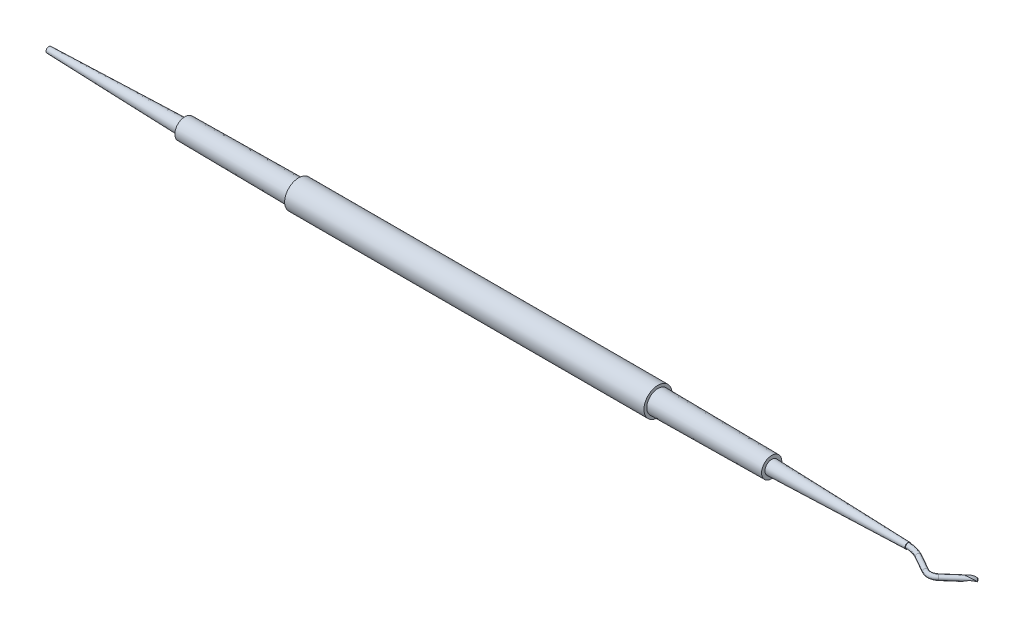
ISO-10303-21;
HEADER;
FILE_DESCRIPTION(('STEP AP214'),'2;1');
FILE_NAME('part.step','',(''),(''),'','','');
FILE_SCHEMA(('AUTOMOTIVE_DESIGN { 1 0 10303 214 1 1 1 1 }'));
ENDSEC;
DATA;
#1=APPLICATION_CONTEXT('core data for automotive mechanical design processes');
#2=APPLICATION_PROTOCOL_DEFINITION('international standard','automotive_design',2000,#1);
#3=PRODUCT_CONTEXT('',#1,'mechanical');
#4=PRODUCT('Part','Part','',(#3));
#5=PRODUCT_RELATED_PRODUCT_CATEGORY('part','',(#4));
#6=PRODUCT_DEFINITION_FORMATION('','',#4);
#7=PRODUCT_DEFINITION_CONTEXT('part definition',#1,'design');
#8=PRODUCT_DEFINITION('design','',#6,#7);
#9=PRODUCT_DEFINITION_SHAPE('','',#8);
#10=(LENGTH_UNIT() NAMED_UNIT(*) SI_UNIT(.MILLI.,.METRE.));
#11=(NAMED_UNIT(*) PLANE_ANGLE_UNIT() SI_UNIT($,.RADIAN.));
#12=(NAMED_UNIT(*) SI_UNIT($,.STERADIAN.) SOLID_ANGLE_UNIT());
#13=UNCERTAINTY_MEASURE_WITH_UNIT(LENGTH_MEASURE(1.E-05),#10,'distance_accuracy_value','');
#14=(GEOMETRIC_REPRESENTATION_CONTEXT(3) GLOBAL_UNCERTAINTY_ASSIGNED_CONTEXT((#13)) GLOBAL_UNIT_ASSIGNED_CONTEXT((#10,
#11,#12)) REPRESENTATION_CONTEXT('',''));
#15=CARTESIAN_POINT('',(0.,0.,0.));
#16=DIRECTION('',(0.,0.,1.));
#17=DIRECTION('',(1.,0.,0.));
#18=AXIS2_PLACEMENT_3D('',#15,#16,#17);
#19=CARTESIAN_POINT('',(63.6969930566618,0.,-30.1608804847367));
#20=DIRECTION('',(0.707106781186546,5.9604644836623E-08,-0.707106781186546));
#21=DIRECTION('',(-0.707106781186548,0.,-0.707106781186548));
#22=AXIS2_PLACEMENT_3D('',#19,#20,#21);
#23=CIRCLE('',#22,0.425000000000001);
#24=DIRECTION('',(0.752843126221306,0.,-0.658199990353487));
#25=VECTOR('',#24,1.);
#26=SURFACE_OF_LINEAR_EXTRUSION('',#23,#25);
#27=CARTESIAN_POINT('',(63.3964726746575,0.,-30.4614008667409));
#28=VERTEX_POINT('',#27);
#29=EDGE_CURVE('E174',#28,#28,#23,.T.);
#30=ORIENTED_EDGE('',*,*,#29,.T.);
#31=EDGE_LOOP('',(#30));
#32=FACE_BOUND('',#31,.T.);
#33=CARTESIAN_POINT('',(67.6511873969928,-0.258658752841257,-33.1710451259865));
#34=CARTESIAN_POINT('',(67.6528045494839,-0.24429116295213,-33.1579142887532));
#35=CARTESIAN_POINT('',(67.6535727690092,-0.229456959110943,-33.1453880770501));
#36=CARTESIAN_POINT('',(67.653411342128,-0.198855323524447,-33.1215449047044));
#37=CARTESIAN_POINT('',(67.6524816957216,-0.183087891779138,-33.1102279440617));
#38=CARTESIAN_POINT('',(67.6507031163494,-0.166853846081768,-33.0995156089493));
#39=B_SPLINE_CURVE_WITH_KNOTS('',3,(#33,#34,#35,#36,#37,#38),.UNSPECIFIED.,.F.,.F.,(4,2,4),(0.,
0.0582919179667387,0.116583835933478),.UNSPECIFIED.);
#40=CARTESIAN_POINT('',(67.6511873969928,-0.258658752841257,-33.1710451259865));
#41=VERTEX_POINT('',#40);
#42=CARTESIAN_POINT('',(67.6507031163494,-0.166853846081765,-33.0995156089493));
#43=VERTEX_POINT('',#42);
#44=EDGE_CURVE('E47',#41,#43,#39,.T.);
#45=ORIENTED_EDGE('',*,*,#44,.T.);
#46=CARTESIAN_POINT('',(67.6507031163494,-0.166853846081757,-33.0995156089493));
#47=CARTESIAN_POINT('',(67.6437455442857,-0.156078227115985,-33.08733965316));
#48=CARTESIAN_POINT('',(67.6362743139802,-0.145346648935356,-33.07543088082));
#49=CARTESIAN_POINT('',(67.6204099658853,-0.124034160674299,-33.0521217833227));
#50=CARTESIAN_POINT('',(67.6120175476423,-0.113453143063015,-33.0407210814638));
#51=CARTESIAN_POINT('',(67.5875937174699,-0.0843793389244943,-33.0097447208781));
#52=CARTESIAN_POINT('',(67.5706749068561,-0.0660976993231702,-32.990667082251));
#53=CARTESIAN_POINT('',(67.5346907839806,-0.0303530884627027,-32.953796697354));
#54=CARTESIAN_POINT('',(67.5156235172787,-0.0128908834262404,-32.9360051455755));
#55=CARTESIAN_POINT('',(67.4558715775179,0.0379787119219545,-32.8844072292486));
#56=CARTESIAN_POINT('',(67.4125398571444,0.0699805907076151,-32.8522626271264));
#57=CARTESIAN_POINT('',(67.3210207243787,0.129735904654552,-32.7913984281136));
#58=CARTESIAN_POINT('',(67.2728372215585,0.15749271577668,-32.7626761136504));
#59=CARTESIAN_POINT('',(67.1729461661692,0.208757610183487,-32.7077879807982));
#60=CARTESIAN_POINT('',(67.1212401551242,0.232267535755102,-32.6816210561623));
#61=CARTESIAN_POINT('',(67.0152664141436,0.275107483525564,-32.6312127860484));
#62=CARTESIAN_POINT('',(66.9609993363274,0.294438562854347,-32.6069709545602));
#63=CARTESIAN_POINT('',(66.8506006968685,0.329027529275209,-32.5599202414545));
#64=CARTESIAN_POINT('',(66.7944694239258,0.344286043791555,-32.5371111395235));
#65=CARTESIAN_POINT('',(66.6808786659113,0.370828459307692,-32.4925549487387));
#66=CARTESIAN_POINT('',(66.6234193071219,0.382112736559233,-32.4708077595188));
#67=CARTESIAN_POINT('',(66.5062091594492,0.401011375293602,-32.4275514743997));
#68=CARTESIAN_POINT('',(66.4464364163068,0.408531676929487,-32.4060604617622));
#69=CARTESIAN_POINT('',(66.3679282345576,0.41572425609031,-32.3785891610623));
#70=CARTESIAN_POINT('',(66.3494924808867,0.417221578234038,-32.3721921573082));
#71=CARTESIAN_POINT('',(66.3125454844976,0.419839639900346,-32.3595421650755));
#72=CARTESIAN_POINT('',(66.2940342456117,0.420960398306228,-32.3532891693901));
#73=CARTESIAN_POINT('',(66.2636425512783,0.42248601501354,-32.3433443001972));
#74=CARTESIAN_POINT('',(66.2518026655252,0.423002942848195,-32.3395491143053));
#75=CARTESIAN_POINT('',(66.2323990359157,0.42372120317685,-32.3336754765893));
#76=CARTESIAN_POINT('',(66.2248715356617,0.423968575195228,-32.3314807946055));
#77=CARTESIAN_POINT('',(66.2123507132798,0.424326063527001,-32.3281683299119));
#78=CARTESIAN_POINT('',(66.2073905551131,0.424453942341993,-32.3269421468421));
#79=CARTESIAN_POINT('',(66.1990931601383,0.424643061234417,-32.3252475693451));
#80=CARTESIAN_POINT('',(66.1957766236008,0.424712186131435,-32.324663234684));
#81=CARTESIAN_POINT('',(66.1891855006548,0.424834964550152,-32.3238696410187));
#82=CARTESIAN_POINT('',(66.1859140974136,0.424889105592861,-32.323646991518));
#83=CARTESIAN_POINT('',(66.1814748726344,0.424948121658036,-32.3241494061104));
#84=CARTESIAN_POINT('',(66.1802669068749,0.424962669605739,-32.324370237));
#85=CARTESIAN_POINT('',(66.1779226235479,0.424986089391464,-32.3251535324298));
#86=CARTESIAN_POINT('',(66.1767872134721,0.424994898672586,-32.3257196359968));
#87=CARTESIAN_POINT('',(66.1751563812516,0.425000793818929,-32.3270949986066));
#88=CARTESIAN_POINT('',(66.1745707888271,0.425000460160245,-32.3277927311136));
#89=CARTESIAN_POINT('',(66.1736673073348,0.424994359684992,-32.3293328655104));
#90=CARTESIAN_POINT('',(66.1733484062992,0.424988613584307,-32.3301747057859));
#91=CARTESIAN_POINT('',(66.1727155492817,0.42496713263638,-32.3326515426011));
#92=CARTESIAN_POINT('',(66.172648457182,0.424947056848973,-32.3343379718675));
#93=CARTESIAN_POINT('',(66.1728723287709,0.424877894302242,-32.3394063916986));
#94=CARTESIAN_POINT('',(66.1736066208746,0.424820308891583,-32.3427335956496));
#95=CARTESIAN_POINT('',(66.1754001750184,0.424691350473712,-32.3493117416951));
#96=CARTESIAN_POINT('',(66.1764627017238,0.424619841751555,-32.3525615474696));
#97=CARTESIAN_POINT('',(66.1798451387075,0.424389906937479,-32.3620948741987));
#98=CARTESIAN_POINT('',(66.1823935459102,0.42421390184582,-32.3682983355549));
#99=CARTESIAN_POINT('',(66.187683162078,0.423817070036864,-32.3806211981264));
#100=CARTESIAN_POINT('',(66.1904246135467,0.42359618626183,-32.3867404816386));
#101=CARTESIAN_POINT('',(66.1959969041315,0.423111527548993,-32.3988896795957));
#102=CARTESIAN_POINT('',(66.1988270402961,0.422848042969012,-32.4049199168643));
#103=CARTESIAN_POINT('',(66.2045443914714,0.422277550581856,-32.4169460955671));
#104=CARTESIAN_POINT('',(66.2074315715549,0.421970568737712,-32.4229420552562));
#105=CARTESIAN_POINT('',(66.2219631619519,0.420325503979314,-32.4528953249947));
#106=CARTESIAN_POINT('',(66.2338650061401,0.418659760019526,-32.4767107237203));
#107=CARTESIAN_POINT('',(66.2578395314483,0.414627654725028,-32.5242035675893));
#108=CARTESIAN_POINT('',(66.2699122693541,0.412261055041607,-32.5478809630024));
#109=CARTESIAN_POINT('',(66.2942088179677,0.406819375520685,-32.5951311620099));
#110=CARTESIAN_POINT('',(66.3064328597344,0.40374303949088,-32.6187037037108));
#111=CARTESIAN_POINT('',(66.3309943941912,0.396880683550806,-32.6656818919974));
#112=CARTESIAN_POINT('',(66.3433318762392,0.393094729578351,-32.6890875538801));
#113=CARTESIAN_POINT('',(66.3804659430073,0.38068550605793,-32.7588984901474));
#114=CARTESIAN_POINT('',(66.4054478021747,0.370996653728389,-32.8050218097191));
#115=CARTESIAN_POINT('',(66.4560308067797,0.348725398149464,-32.8962219659259));
#116=CARTESIAN_POINT('',(66.4816319822873,0.336142854147587,-32.9412987515388));
#117=CARTESIAN_POINT('',(66.5337036377941,0.307989507963047,-33.0301650803742));
#118=CARTESIAN_POINT('',(66.5601761406788,0.292411275751515,-33.0739511040906));
#119=CARTESIAN_POINT('',(66.6141500341152,0.258227406575446,-33.159665137125));
#120=CARTESIAN_POINT('',(66.6416512223902,0.239622362406729,-33.2015935082193));
#121=CARTESIAN_POINT('',(66.6979116412786,0.199368026463909,-33.2829544007512));
#122=CARTESIAN_POINT('',(66.72666831356,0.177724743033453,-33.3223916306471));
#123=CARTESIAN_POINT('',(66.7858422184484,0.131341943507186,-33.3981218761712));
#124=CARTESIAN_POINT('',(66.8162599087895,0.10660157148021,-33.4344140178924));
#125=CARTESIAN_POINT('',(66.8791911294972,0.0540883064027667,-33.5028364489158));
#126=CARTESIAN_POINT('',(66.9117056257442,0.0263140116479241,-33.534964799387));
#127=CARTESIAN_POINT('',(66.9749562987444,-0.0281961748381158,-33.5897805263988));
#128=CARTESIAN_POINT('',(67.0053752170644,-0.0545986506160452,-33.6131520876014));
#129=CARTESIAN_POINT('',(67.0530307302808,-0.09562398207578,-33.6441524944955));
#130=CARTESIAN_POINT('',(67.0694075219606,-0.109666427796053,-33.6538770488798));
#131=CARTESIAN_POINT('',(67.1028395377284,-0.138061412966175,-33.6716378723126));
#132=CARTESIAN_POINT('',(67.11989571802,-0.152414375476507,-33.6796716540989));
#133=CARTESIAN_POINT('',(67.137306241785,-0.166853846081759,-33.6867342563268));
#134=B_SPLINE_CURVE_WITH_KNOTS('',3,(#46,#47,#48,#49,#50,#51,#52,#53,#54,#55,#56,#57,#58,#59,
#60,#61,#62,#63,#64,#65,#66,#67,#68,#69,#70,#71,#72,#73,#74,#75,#76,#77,#78,#79,#80,#81,#82,#83,
#84,#85,#86,#87,#88,#89,#90,#91,#92,#93,#94,#95,#96,#97,#98,#99,#100,#101,#102,#103,#104,#105,
#106,#107,#108,#109,#110,#111,#112,#113,#114,#115,#116,#117,#118,#119,#120,#121,#122,#123,#124,
#125,#126,#127,#128,#129,#130,#131,#132,#133),.UNSPECIFIED.,.F.,.F.,(4,2,2,2,2,2,2,2,2,2,2,2,2,
2,2,2,2,2,2,2,2,2,2,2,2,2,2,2,2,2,2,2,2,2,2,2,2,2,2,2,2,2,2,4),(0.,0.0530330355999665,
0.106026073177627,0.200010813964857,0.294081753204683,0.481667918282324,0.669104117794824,
0.856458811727566,1.04376605461255,1.23104442403847,1.41830505854752,1.61003691416296,
1.66874862900401,1.72745739922639,1.76478323653067,1.78831905059973,1.80363450989081,
1.81375060771837,1.82348286278468,1.82714866496847,1.83085378731138,1.8335277001599,
1.83619142013251,1.84117821033633,1.85133505623803,1.8615963660805,1.88170022115322,
1.90182979757174,1.92182754977982,1.94181341544612,2.02182594460916,2.10186571593596,
2.18204825486523,2.26222334691014,2.42215353645507,2.58209150683444,2.74243140116676,
2.90273993093132,3.06273579142086,3.22277596741169,3.38289039891325,3.52221527905958,
3.5931408208341,3.66416998151407),.UNSPECIFIED.);
#135=CARTESIAN_POINT('',(67.137306241785,-0.166853846081765,-33.6867342563268));
#136=VERTEX_POINT('',#135);
#137=EDGE_CURVE('E11',#43,#136,#134,.T.);
#138=ORIENTED_EDGE('',*,*,#137,.T.);
#139=CARTESIAN_POINT('',(67.137306241785,-0.166853846081765,-33.6867342563268));
#140=CARTESIAN_POINT('',(67.1481601443111,-0.183087891771699,-33.6870663198518));
#141=CARTESIAN_POINT('',(67.1594998853307,-0.198855323513189,-33.6864763095287));
#142=CARTESIAN_POINT('',(67.1831510443566,-0.229456959099287,-33.6834521411864));
#143=CARTESIAN_POINT('',(67.195462462363,-0.244291162943894,-33.6810179831672));
#144=CARTESIAN_POINT('',(67.2082597188628,-0.258658752840058,-33.6776617512999));
#145=B_SPLINE_CURVE_WITH_KNOTS('',3,(#139,#140,#141,#142,#143,#144),.UNSPECIFIED.,.F.,.F.,(4,2,
4),(0.,0.0582919177986592,0.116583835597326),.UNSPECIFIED.);
#146=CARTESIAN_POINT('',(67.2082597188621,-0.258658752841257,-33.6776617512993));
#147=VERTEX_POINT('',#146);
#148=EDGE_CURVE('E94',#136,#147,#145,.T.);
#149=ORIENTED_EDGE('',*,*,#148,.T.);
#150=CARTESIAN_POINT('',(67.2082597188626,-0.258658752841215,-33.6776617512987));
#151=CARTESIAN_POINT('',(67.1802820012183,-0.245570495625067,-33.6664479209341));
#152=CARTESIAN_POINT('',(67.152771234666,-0.232928934422802,-33.6537098257842));
#153=CARTESIAN_POINT('',(67.0985946905032,-0.208753178425956,-33.625853853145));
#154=CARTESIAN_POINT('',(67.0719265347801,-0.197215637115919,-33.6107435594707));
#155=CARTESIAN_POINT('',(67.0052884862757,-0.169629940565738,-33.5703088847398));
#156=CARTESIAN_POINT('',(66.9657061785008,-0.15440439226653,-33.5437948069971));
#157=CARTESIAN_POINT('',(66.8873210973976,-0.127074523450579,-33.4879745468059));
#158=CARTESIAN_POINT('',(66.8485204574919,-0.114977895252638,-33.4586617212457));
#159=CARTESIAN_POINT('',(66.7711599088592,-0.0940022735049208,-33.3980789908946));
#160=CARTESIAN_POINT('',(66.7326032636704,-0.0851449739298108,-33.3667974785005));
#161=CARTESIAN_POINT('',(66.6557414659007,-0.0708179745754755,-33.3031420228818));
#162=CARTESIAN_POINT('',(66.6174364230336,-0.0653496666439142,-33.2707676365655));
#163=CARTESIAN_POINT('',(66.5410209775717,-0.0578366256922296,-33.205417244065));
#164=CARTESIAN_POINT('',(66.5029105301574,-0.0557910652641313,-33.1724413852286));
#165=CARTESIAN_POINT('',(66.4269694700037,-0.0551310684600747,-33.106161475021));
#166=CARTESIAN_POINT('',(66.3891387723274,-0.0565155438303682,-33.0728575310812));
#167=CARTESIAN_POINT('',(66.3067945706879,-0.0632993399987038,-32.9995950860713));
#168=CARTESIAN_POINT('',(66.2623868885887,-0.0694159464142125,-32.9595821945022));
#169=CARTESIAN_POINT('',(66.1750515064675,-0.0864580434115003,-32.8790154819311));
#170=CARTESIAN_POINT('',(66.1321227571341,-0.0973800454726768,-32.8384620739934));
#171=CARTESIAN_POINT('',(66.0637470241865,-0.119180382665745,-32.7708847367859));
#172=CARTESIAN_POINT('',(66.0375270206458,-0.128684226637528,-32.7441954607835));
#173=CARTESIAN_POINT('',(65.9866359410563,-0.149564266150504,-32.6901168330276));
#174=CARTESIAN_POINT('',(65.9619636384875,-0.160938952518723,-32.662728060466));
#175=CARTESIAN_POINT('',(65.9141966352896,-0.185735848511297,-32.6063023214763));
#176=CARTESIAN_POINT('',(65.8911490898595,-0.19919789163293,-32.5772422678051));
#177=CARTESIAN_POINT('',(65.8588658842258,-0.220625011124829,-32.5325200233485));
#178=CARTESIAN_POINT('',(65.848472883833,-0.227984529871102,-32.5174013662388));
#179=CARTESIAN_POINT('',(65.8286102466047,-0.243064632599637,-32.4867269959797));
#180=CARTESIAN_POINT('',(65.8191412781775,-0.250785472060949,-32.4711709767848));
#181=CARTESIAN_POINT('',(65.8102148753809,-0.258658752841249,-32.4553711167116));
#182=B_SPLINE_CURVE_WITH_KNOTS('',3,(#150,#151,#152,#153,#154,#155,#156,#157,#158,#159,#160,
#161,#162,#163,#164,#165,#166,#167,#168,#169,#170,#171,#172,#173,#174,#175,#176,#177,#178,#179,
#180,#181),.UNSPECIFIED.,.F.,.F.,(4,2,2,2,2,2,2,2,2,2,2,2,2,2,2,4),(0.,0.0984586315110298,
0.196608675093287,0.346424599443237,0.496605412468146,0.647774335110639,0.799005301258977,
0.9501997038587,1.10134614287648,1.28140305838815,1.46132947507233,1.57706667843567,
1.69271097263077,1.81092139927881,1.8701972529889,1.92951567153437),.UNSPECIFIED.);
#183=CARTESIAN_POINT('',(65.8102148753789,-0.258658752841257,-32.4553711167139));
#184=VERTEX_POINT('',#183);
#185=EDGE_CURVE('E83',#147,#184,#182,.T.);
#186=ORIENTED_EDGE('',*,*,#185,.T.);
#187=CARTESIAN_POINT('',(66.2900205884006,0.0674437386742544,-32.9840509806894));
#188=CARTESIAN_POINT('',(66.2643997822545,0.0527406776402467,-32.9647753499176));
#189=CARTESIAN_POINT('',(66.2392572877631,0.0380179738631719,-32.9448877289413));
#190=CARTESIAN_POINT('',(66.1899604255579,0.00855793825302269,-32.9039339439726));
#191=CARTESIAN_POINT('',(66.1658060489455,-0.00617939344709588,-32.8828677905974));
#192=CARTESIAN_POINT('',(66.0948363621088,-0.0503987428245335,-32.8179368447281));
#193=CARTESIAN_POINT('',(66.0495528481736,-0.0798660859064056,-32.7723684840827));
#194=CARTESIAN_POINT('',(65.9637472764439,-0.138524835060358,-32.6766973779446));
#195=CARTESIAN_POINT('',(65.9232265166547,-0.167716163925588,-32.6265934029051));
#196=CARTESIAN_POINT('',(65.8672156689508,-0.210983061157589,-32.5476996767273));
#197=CARTESIAN_POINT('',(65.8493275668627,-0.22533037593558,-32.520754873225));
#198=CARTESIAN_POINT('',(65.8155305379099,-0.253749559447364,-32.4655116066498));
#199=CARTESIAN_POINT('',(65.7996208546331,-0.267821531708544,-32.4372136666885));
#200=CARTESIAN_POINT('',(65.7703732126167,-0.29551805495409,-32.3791545991734));
#201=CARTESIAN_POINT('',(65.7570315929455,-0.309143219537263,-32.3493956315639));
#202=CARTESIAN_POINT('',(65.7338395709497,-0.335711879623463,-32.2881367808883));
#203=CARTESIAN_POINT('',(65.7239926978349,-0.348654674864151,-32.2566351748855));
#204=CARTESIAN_POINT('',(65.7122411175268,-0.36889849744288,-32.203188786204));
#205=CARTESIAN_POINT('',(65.7087631039807,-0.376589332624566,-32.1817555704411));
#206=CARTESIAN_POINT('',(65.70505406464,-0.391014155183455,-32.1383367907528));
#207=CARTESIAN_POINT('',(65.7048121490201,-0.397751276137085,-32.1163533288406));
#208=CARTESIAN_POINT('',(65.7092374067538,-0.410019190209617,-32.0707572691874));
#209=CARTESIAN_POINT('',(65.7142199457168,-0.415445102257521,-32.0471304973399));
#210=CARTESIAN_POINT('',(65.727368871278,-0.421147640296118,-32.013249085589));
#211=CARTESIAN_POINT('',(65.7327603495666,-0.42264424115994,-32.0021374339362));
#212=CARTESIAN_POINT('',(65.7455467762826,-0.424605743217495,-31.9810314250443));
#213=CARTESIAN_POINT('',(65.7529381911805,-0.425072450857632,-31.9710351407333));
#214=CARTESIAN_POINT('',(65.7682747598701,-0.424920644512247,-31.9539948980804));
#215=CARTESIAN_POINT('',(65.7759815758156,-0.424450602347291,-31.9467329817304));
#216=CARTESIAN_POINT('',(65.7923937396488,-0.422765058893588,-31.9335301134082));
#217=CARTESIAN_POINT('',(65.8011008786003,-0.421548202990423,-31.9275915886235));
#218=CARTESIAN_POINT('',(65.8332120102835,-0.416089949075966,-31.9088978203654));
#219=CARTESIAN_POINT('',(65.858471300073,-0.410084367578449,-31.8998495546026));
#220=CARTESIAN_POINT('',(65.9049295570339,-0.397187487354217,-31.8893236866796));
#221=CARTESIAN_POINT('',(65.9260597648345,-0.390638689784297,-31.8867930706796));
#222=CARTESIAN_POINT('',(65.9682192132868,-0.376651427702967,-31.8847868779945));
#223=CARTESIAN_POINT('',(65.9892480838433,-0.369210840083617,-31.8853187395949));
#224=CARTESIAN_POINT('',(66.0310946172084,-0.353710599862177,-31.8886694967027));
#225=CARTESIAN_POINT('',(66.0519080814141,-0.345645512863017,-31.8915111503584));
#226=CARTESIAN_POINT('',(66.0930731445994,-0.329143346677167,-31.8989518365643));
#227=CARTESIAN_POINT('',(66.1134244450131,-0.320706036833223,-31.9035519727274));
#228=CARTESIAN_POINT('',(66.1551239676478,-0.302946258973837,-31.9145366315719));
#229=CARTESIAN_POINT('',(66.1764353253044,-0.293604347142389,-31.921027564037));
#230=CARTESIAN_POINT('',(66.2185314052475,-0.274707727915836,-31.9353148888147));
#231=CARTESIAN_POINT('',(66.2393157820186,-0.265152888252404,-31.9431121133533));
#232=CARTESIAN_POINT('',(66.2806197882083,-0.245774169191445,-31.9598983138725));
#233=CARTESIAN_POINT('',(66.301133012435,-0.235948425967503,-31.9689007743332));
#234=CARTESIAN_POINT('',(66.3416187427822,-0.216195802040492,-31.9878583326351));
#235=CARTESIAN_POINT('',(66.3615920511617,-0.206269105423032,-31.9978119046214));
#236=CARTESIAN_POINT('',(66.3813224345087,-0.196302899475698,-32.0081738750472));
#237=B_SPLINE_CURVE_WITH_KNOTS('',3,(#187,#188,#189,#190,#191,#192,#193,#194,#195,#196,#197,
#198,#199,#200,#201,#202,#203,#204,#205,#206,#207,#208,#209,#210,#211,#212,#213,#214,#215,#216,
#217,#218,#219,#220,#221,#222,#223,#224,#225,#226,#227,#228,#229,#230,#231,#232,#233,#234,#235,
#236),.UNSPECIFIED.,.F.,.F.,(4,2,2,2,2,2,2,2,2,2,2,2,2,2,2,2,2,2,2,2,2,2,2,2,4),(0.,
0.105800013367014,0.211599073746606,0.42335518233639,0.635168868186571,0.741252056558328,
0.847294560454202,0.95318475615018,1.05918158401838,1.12810067102071,1.19678777915251,
1.26987354609439,1.30697977257714,1.34402086233903,1.37565481941378,1.40734632629246,
1.48817493544366,1.55476192449799,1.62151071118521,1.68892525560625,1.75638217863308,
1.8288037904344,1.90127171803265,1.97463140552348,2.04787531824744),.UNSPECIFIED.);
#238=CARTESIAN_POINT('',(66.2531425535137,-0.258658752839964,-31.9487544914006));
#239=VERTEX_POINT('',#238);
#240=EDGE_CURVE('E78',#184,#239,#237,.T.);
#241=ORIENTED_EDGE('',*,*,#240,.T.);
#242=CARTESIAN_POINT('',(66.2531425535109,-0.258658752841259,-31.9487544913995));
#243=CARTESIAN_POINT('',(66.2811184433904,-0.245571399606541,-31.959967516509));
#244=CARTESIAN_POINT('',(66.3086273031949,-0.232930675200975,-31.9727046470512));
#245=CARTESIAN_POINT('',(66.3628038557105,-0.208754769294081,-32.0005603195098));
#246=CARTESIAN_POINT('',(66.3894738223382,-0.197216387984019,-32.0156716098462));
#247=CARTESIAN_POINT('',(66.4565496326794,-0.169449581303954,-32.0563716825776));
#248=CARTESIAN_POINT('',(66.4965533551331,-0.154075043538436,-32.0831953281891));
#249=CARTESIAN_POINT('',(66.575712405549,-0.126537309497611,-32.1396410888984));
#250=CARTESIAN_POINT('',(66.6148668189258,-0.114377431288413,-32.1692660529494));
#251=CARTESIAN_POINT('',(66.6928782360191,-0.0933540311036968,-32.2304472531736));
#252=CARTESIAN_POINT('',(66.731732677842,-0.0845077676160026,-32.2620126305327));
#253=CARTESIAN_POINT('',(66.8091597111309,-0.070264007169429,-32.3262107512928));
#254=CARTESIAN_POINT('',(66.8477324070188,-0.0648651609243523,-32.3588430718391));
#255=CARTESIAN_POINT('',(66.9244309726151,-0.0575644709316384,-32.4244917271417));
#256=CARTESIAN_POINT('',(66.9625581039543,-0.0556394115744727,-32.4575040174097));
#257=CARTESIAN_POINT('',(67.0385471601704,-0.055224852727571,-32.5238677976532));
#258=CARTESIAN_POINT('',(67.0764090358043,-0.0567359750329596,-32.5572193479325));
#259=CARTESIAN_POINT('',(67.1515152029923,-0.063179548693823,-32.6241007622875));
#260=CARTESIAN_POINT('',(67.188760779109,-0.0681036186604254,-32.657629990292));
#261=CARTESIAN_POINT('',(67.2622922151856,-0.0813362454996726,-32.7250485198451));
#262=CARTESIAN_POINT('',(67.2985784407945,-0.0896434925044792,-32.7589376770996));
#263=CARTESIAN_POINT('',(67.3643181226703,-0.108110395649817,-32.8223153855905));
#264=CARTESIAN_POINT('',(67.3939876927776,-0.117813577685142,-32.8517124538313));
#265=CARTESIAN_POINT('',(67.4516090048666,-0.139556613334639,-32.9112445214609));
#266=CARTESIAN_POINT('',(67.4795629286306,-0.151593414680686,-32.9413785124799));
#267=CARTESIAN_POINT('',(67.5337538788533,-0.178229915766972,-33.0035976224143));
#268=CARTESIAN_POINT('',(67.5599294126721,-0.192886853271706,-33.0357128383802));
#269=CARTESIAN_POINT('',(67.5964782709941,-0.216441901454891,-33.0852532005328));
#270=CARTESIAN_POINT('',(67.6082289580632,-0.224572497867557,-33.1020284562832));
#271=CARTESIAN_POINT('',(67.6306067003276,-0.241290920635079,-33.1361161319714));
#272=CARTESIAN_POINT('',(67.6412327120094,-0.249879160692709,-33.153429031825));
#273=CARTESIAN_POINT('',(67.6511873969928,-0.258658752841244,-33.1710451259864));
#274=B_SPLINE_CURVE_WITH_KNOTS('',3,(#242,#243,#244,#245,#246,#247,#248,#249,#250,#251,#252,
#253,#254,#255,#256,#257,#258,#259,#260,#261,#262,#263,#264,#265,#266,#267,#268,#269,#270,#271,
#272,#273),.UNSPECIFIED.,.F.,.F.,(4,2,2,2,2,2,2,2,2,2,2,2,2,2,2,4),(0.,0.0984518700744764,
0.196608676476319,0.348045861753214,0.49963875058335,0.652010559137899,0.804322694208213,
0.955613090563104,1.10693086588861,1.25787835124327,1.40876744959418,1.53731251753577,
1.66569057503312,1.79732324045698,1.86339642234946,1.92953038155447),.UNSPECIFIED.);
#275=EDGE_CURVE('E89',#239,#41,#274,.T.);
#276=ORIENTED_EDGE('',*,*,#275,.T.);
#277=EDGE_LOOP('',(#45,#138,#149,#186,#241,#276));
#278=FACE_BOUND('',#277,.T.);
#279=ADVANCED_FACE('F32',(#32,#278),#26,.T.);
#280=CARTESIAN_POINT('',(58.6475548694359,0.,-31.6139719657644));
#281=DIRECTION('',(0.901142029145555,5.9604644836623E-08,0.433523982390164));
#282=DIRECTION('',(0.433523982390165,0.,-0.901142029145557));
#283=AXIS2_PLACEMENT_3D('',#280,#281,#282);
#284=CIRCLE('',#283,0.425000000000001);
#285=CARTESIAN_POINT('',(56.1007794856014,0.,-27.1178129547974));
#286=DIRECTION('',(0.,1.,0.));
#287=AXIS1_PLACEMENT('',#285,#286);
#288=SURFACE_OF_REVOLUTION('',#284,#287);
#289=CARTESIAN_POINT('',(58.8318025619517,0.,-31.9969573281512));
#290=VERTEX_POINT('',#289);
#291=EDGE_CURVE('E202',#290,#290,#284,.T.);
#292=ORIENTED_EDGE('',*,*,#291,.F.);
#293=EDGE_LOOP('',(#292));
#294=FACE_BOUND('',#293,.T.);
#295=CARTESIAN_POINT('',(56.1007794856014,0.424999999999832,-32.2851630296092));
#296=CARTESIAN_POINT('',(56.1007794856011,0.425020466931518,-32.3089851707164));
#297=CARTESIAN_POINT('',(56.1007794856012,0.42298934388977,-32.3328008363431));
#298=CARTESIAN_POINT('',(56.1007794856015,0.414975843758688,-32.379739218147));
#299=CARTESIAN_POINT('',(56.1007794856017,0.408996630670456,-32.4028624737228));
#300=CARTESIAN_POINT('',(56.1007794856016,0.393234996082388,-32.4477860774439));
#301=CARTESIAN_POINT('',(56.1007794856013,0.383450917837889,-32.4695858445181));
#302=CARTESIAN_POINT('',(56.1007794856014,0.360368864011758,-32.5112323237803));
#303=CARTESIAN_POINT('',(56.1007794856018,0.347071507258352,-32.5310793790746));
#304=CARTESIAN_POINT('',(56.1007794856018,0.317332419457146,-32.5682747619284));
#305=CARTESIAN_POINT('',(56.1007794856014,0.300889104998015,-32.5856218234591));
#306=CARTESIAN_POINT('',(56.1007794856014,0.265305386508557,-32.6173403888102));
#307=CARTESIAN_POINT('',(56.1007794856019,0.246161214362847,-32.6317076649913));
#308=CARTESIAN_POINT('',(56.1007794856019,0.205725235286263,-32.6570397917126));
#309=CARTESIAN_POINT('',(56.1007794856014,0.184432189205565,-32.6680026640743));
#310=CARTESIAN_POINT('',(56.1007794856014,0.140279707446608,-32.6862204462232));
#311=CARTESIAN_POINT('',(56.100779485602,0.117418101793713,-32.6934700968085));
#312=CARTESIAN_POINT('',(56.100779485602,0.0707998270538761,-32.7040355768036));
#313=CARTESIAN_POINT('',(56.1007794856014,0.0470430249886139,-32.7073508193751));
#314=CARTESIAN_POINT('',(56.1007794856014,-0.000730289591681288,-32.7099549002989));
#315=CARTESIAN_POINT('',(56.1007794856021,-0.0247471706640772,-32.7092369807506));
#316=CARTESIAN_POINT('',(56.1007794856021,-0.0723386801020896,-32.7037768917454));
#317=CARTESIAN_POINT('',(56.1007794856014,-0.0959129387659259,-32.6990314989222));
#318=CARTESIAN_POINT('',(56.1007794856014,-0.141889890360478,-32.6856570874754));
#319=CARTESIAN_POINT('',(56.1007794856021,-0.164294476776442,-32.6770345774357));
#320=CARTESIAN_POINT('',(56.1007794856023,-0.207363720162289,-32.6561374946616));
#321=CARTESIAN_POINT('',(56.1007794856016,-0.228026275491038,-32.6438585894021));
#322=CARTESIAN_POINT('',(56.1007794856011,-0.26696340876817,-32.6160191476977));
#323=CARTESIAN_POINT('',(56.1007794856013,-0.285241327540766,-32.6004632839121));
#324=CARTESIAN_POINT('',(56.1007794856014,-0.318921393184504,-32.5664988698903));
#325=CARTESIAN_POINT('',(56.1007794856014,-0.334323486251836,-32.5480902662939));
#326=CARTESIAN_POINT('',(56.1007794856014,-0.361789093969117,-32.5089701636934));
#327=CARTESIAN_POINT('',(56.1007794856014,-0.373857325728822,-32.488261977199));
#328=CARTESIAN_POINT('',(56.1007794856014,-0.394333141012377,-32.4451221750208));
#329=CARTESIAN_POINT('',(56.1007794856013,-0.402742481422613,-32.4226913925751));
#330=CARTESIAN_POINT('',(56.1007794856015,-0.415652014942598,-32.376762932385));
#331=CARTESIAN_POINT('',(56.1007794856019,-0.420158251242324,-32.3532669634518));
#332=CARTESIAN_POINT('',(56.1007794856019,-0.424222718212436,-32.314818299947));
#333=CARTESIAN_POINT('',(56.1007794856018,-0.425006370058467,-32.2999871531943));
#334=CARTESIAN_POINT('',(56.1007794856014,-0.424999999999832,-32.2851637866598));
#335=B_SPLINE_CURVE_WITH_KNOTS('',3,(#295,#296,#297,#298,#299,#300,#301,#302,#303,#304,#305,
#306,#307,#308,#309,#310,#311,#312,#313,#314,#315,#316,#317,#318,#319,#320,#321,#322,#323,#324,
#325,#326,#327,#328,#329,#330,#331,#332,#333,#334),.UNSPECIFIED.,.F.,.F.,(4,2,2,2,2,2,2,2,2,2,2,
2,2,2,2,2,2,2,2,4),(0.,0.0713706522130541,0.142684177259909,0.214028789040578,0.285360842562652,
0.356728893561818,0.428197517243004,0.49970759143964,0.571318670401143,0.6429404292023,
0.714682232011692,0.786481507184415,0.858160699068,0.929925165125219,1.00158798565507,
1.07325214679001,1.1448143841834,1.21634222158153,1.28775911318768,1.33222924739058),.UNSPECIFIED.);
#336=CARTESIAN_POINT('',(56.1007794856014,0.425,-32.2851630296093));
#337=VERTEX_POINT('',#336);
#338=CARTESIAN_POINT('',(56.1007794856014,-0.424999999999832,-32.2851637866599));
#339=VERTEX_POINT('',#338);
#340=EDGE_CURVE('E168',#337,#339,#335,.T.);
#341=ORIENTED_EDGE('',*,*,#340,.F.);
#342=CARTESIAN_POINT('',(56.1007794856014,0.,-32.2851634081347));
#343=DIRECTION('',(0.997758156276635,5.9604644836623E-08,-0.0669228031648955));
#344=DIRECTION('',(-0.0669228031648955,0.,-0.997758156276636));
#345=AXIS2_PLACEMENT_3D('',#342,#343,#344);
#346=CIRCLE('',#345,0.425000000000001);
#347=EDGE_CURVE('E204',#337,#339,#346,.T.);
#348=ORIENTED_EDGE('',*,*,#347,.T.);
#349=EDGE_LOOP('',(#341,#348));
#350=FACE_BOUND('',#349,.T.);
#351=ADVANCED_FACE('F34',(#294,#350),#288,.T.);
#352=CARTESIAN_POINT('',(56.1007794856014,0.,-32.2851634081347));
#353=DIRECTION('',(0.997758156276635,5.9604644836623E-08,-0.0669228031648955));
#354=DIRECTION('',(-0.0669228031648955,0.,-0.997758156276636));
#355=AXIS2_PLACEMENT_3D('',#352,#353,#354);
#356=PLANE('',#355);
#357=DIRECTION('',(0.,0.999999999999603,8.90647761566945E-07));
#358=VECTOR('',#357,1.);
#359=CARTESIAN_POINT('',(56.1007794856014,0.,-32.2851634081346));
#360=LINE('',#359,#358);
#361=EDGE_CURVE('E60',#339,#337,#360,.T.);
#362=ORIENTED_EDGE('',*,*,#361,.F.);
#363=ORIENTED_EDGE('',*,*,#347,.F.);
#364=EDGE_LOOP('',(#362,#363));
#365=FACE_BOUND('',#364,.T.);
#366=ADVANCED_FACE('F166',(#365),#356,.F.);
#367=CARTESIAN_POINT('',(61.5915639375064,0.,-29.9463864097244));
#368=DIRECTION('',(0.901142029145555,5.9604644836623E-08,0.433523982390164));
#369=DIRECTION('',(0.433523982390165,0.,-0.901142029145557));
#370=AXIS2_PLACEMENT_3D('',#367,#368,#369);
#371=CIRCLE('',#370,0.425000000000001);
#372=DIRECTION('',(-0.870109169402895,0.,-0.492859040011447));
#373=VECTOR('',#372,1.);
#374=SURFACE_OF_LINEAR_EXTRUSION('',#371,#373);
#375=CARTESIAN_POINT('',(61.7758116300222,0.,-30.3293717721112));
#376=VERTEX_POINT('',#375);
#377=EDGE_CURVE('E180',#376,#376,#371,.T.);
#378=ORIENTED_EDGE('',*,*,#377,.F.);
#379=EDGE_LOOP('',(#378));
#380=FACE_BOUND('',#379,.T.);
#381=ORIENTED_EDGE('',*,*,#291,.T.);
#382=EDGE_LOOP('',(#381));
#383=FACE_BOUND('',#382,.T.);
#384=ADVANCED_FACE('F184',(#380,#383),#374,.F.);
#385=CARTESIAN_POINT('',(62.4930639884204,0.,-31.5379235366467));
#386=DIRECTION('',(0.,-1.,0.));
#387=AXIS1_PLACEMENT('',#385,#386);
#388=SURFACE_OF_REVOLUTION('',#23,#387);
#389=ORIENTED_EDGE('',*,*,#29,.F.);
#390=EDGE_LOOP('',(#389));
#391=FACE_BOUND('',#390,.T.);
#392=ORIENTED_EDGE('',*,*,#377,.T.);
#393=EDGE_LOOP('',(#392));
#394=FACE_BOUND('',#393,.T.);
#395=ADVANCED_FACE('F164',(#391,#394),#388,.T.);
#396=CARTESIAN_POINT('',(56.1007794856014,0.,-32.2851634081347));
#397=DIRECTION('',(-1.,0.,0.));
#398=DIRECTION('',(0.,0.,1.));
#399=AXIS2_PLACEMENT_3D('',#396,#397,#398);
#400=PLANE('',#399);
#401=CARTESIAN_POINT('',(56.1007794856014,0.,-32.2851634081347));
#402=DIRECTION('',(1.,0.,0.));
#403=DIRECTION('',(0.,0.,-1.));
#404=AXIS2_PLACEMENT_3D('',#401,#402,#403);
#405=CIRCLE('',#404,0.500000000000021);
#406=CARTESIAN_POINT('',(56.1007794856014,0.,-32.7851634081347));
#407=VERTEX_POINT('',#406);
#408=EDGE_CURVE('E175',#407,#407,#405,.T.);
#409=ORIENTED_EDGE('',*,*,#408,.T.);
#410=EDGE_LOOP('',(#409));
#411=FACE_BOUND('',#410,.T.);
#412=ORIENTED_EDGE('',*,*,#361,.T.);
#413=ORIENTED_EDGE('',*,*,#340,.T.);
#414=EDGE_LOOP('',(#412,#413));
#415=FACE_BOUND('',#414,.T.);
#416=ADVANCED_FACE('F160',(#411,#415),#400,.F.);
#417=CARTESIAN_POINT('',(31.8502314966675,0.,-32.2851634081347));
#418=DIRECTION('',(-1.,0.,0.));
#419=DIRECTION('',(0.,0.,1.));
#420=AXIS2_PLACEMENT_3D('',#417,#418,#419);
#421=CONICAL_SURFACE('',#420,1.20000000000002,0.0288573141713058);
#422=ORIENTED_EDGE('',*,*,#408,.F.);
#423=EDGE_LOOP('',(#422));
#424=FACE_BOUND('',#423,.T.);
#425=CARTESIAN_POINT('',(31.8502314966675,0.,-32.2851634081347));
#426=DIRECTION('',(1.,0.,0.));
#427=DIRECTION('',(0.,0.,-1.));
#428=AXIS2_PLACEMENT_3D('',#425,#426,#427);
#429=CIRCLE('',#428,1.20000000000002);
#430=CARTESIAN_POINT('',(31.8502314966675,0.,-33.4851634081347));
#431=VERTEX_POINT('',#430);
#432=EDGE_CURVE('E360',#431,#431,#429,.T.);
#433=ORIENTED_EDGE('',*,*,#432,.T.);
#434=EDGE_LOOP('',(#433));
#435=FACE_BOUND('',#434,.T.);
#436=ADVANCED_FACE('F156',(#424,#435),#421,.T.);
#437=CARTESIAN_POINT('',(31.8502314966675,0.,-31.0851634081347));
#438=DIRECTION('',(-1.,0.,0.));
#439=DIRECTION('',(0.,0.,1.));
#440=AXIS2_PLACEMENT_3D('',#437,#438,#439);
#441=PLANE('',#440);
#442=ORIENTED_EDGE('',*,*,#432,.F.);
#443=EDGE_LOOP('',(#442));
#444=FACE_BOUND('',#443,.T.);
#445=CARTESIAN_POINT('',(31.8502314966675,0.,-32.2851634081347));
#446=DIRECTION('',(1.,0.,0.));
#447=DIRECTION('',(0.,0.,-1.));
#448=AXIS2_PLACEMENT_3D('',#445,#446,#447);
#449=CIRCLE('',#448,1.80000000000002);
#450=CARTESIAN_POINT('',(31.8502314966675,0.,-34.0851634081347));
#451=VERTEX_POINT('',#450);
#452=EDGE_CURVE('E358',#451,#451,#449,.T.);
#453=ORIENTED_EDGE('',*,*,#452,.T.);
#454=EDGE_LOOP('',(#453));
#455=FACE_BOUND('',#454,.T.);
#456=ADVANCED_FACE('F152',(#444,#455),#441,.F.);
#457=CARTESIAN_POINT('',(11.5916478874554,0.,-32.2851634081347));
#458=DIRECTION('',(-1.,0.,0.));
#459=DIRECTION('',(0.,0.,1.));
#460=AXIS2_PLACEMENT_3D('',#457,#458,#459);
#461=CONICAL_SURFACE('',#460,2.00000000000003,0.00987203778278252);
#462=ORIENTED_EDGE('',*,*,#452,.F.);
#463=EDGE_LOOP('',(#462));
#464=FACE_BOUND('',#463,.T.);
#465=CARTESIAN_POINT('',(11.5916478874554,0.,-32.2851634081347));
#466=DIRECTION('',(1.,0.,0.));
#467=DIRECTION('',(0.,0.,-1.));
#468=AXIS2_PLACEMENT_3D('',#465,#466,#467);
#469=CIRCLE('',#468,2.00000000000003);
#470=CARTESIAN_POINT('',(11.5916478874554,0.,-34.2851634081347));
#471=VERTEX_POINT('',#470);
#472=EDGE_CURVE('E355',#471,#471,#469,.T.);
#473=ORIENTED_EDGE('',*,*,#472,.T.);
#474=EDGE_LOOP('',(#473));
#475=FACE_BOUND('',#474,.T.);
#476=ADVANCED_FACE('F148',(#464,#475),#461,.T.);
#477=CARTESIAN_POINT('',(11.5916478874554,0.,-30.2851634081347));
#478=DIRECTION('',(-1.,0.,0.));
#479=DIRECTION('',(0.,0.,1.));
#480=AXIS2_PLACEMENT_3D('',#477,#478,#479);
#481=PLANE('',#480);
#482=ORIENTED_EDGE('',*,*,#472,.F.);
#483=EDGE_LOOP('',(#482));
#484=FACE_BOUND('',#483,.T.);
#485=CARTESIAN_POINT('',(11.5916478874554,0.,-32.2851634081347));
#486=DIRECTION('',(1.,0.,0.));
#487=DIRECTION('',(0.,0.,-1.));
#488=AXIS2_PLACEMENT_3D('',#485,#486,#487);
#489=CIRCLE('',#488,2.50000000000003);
#490=CARTESIAN_POINT('',(11.5916478874554,0.,-34.7851634081347));
#491=VERTEX_POINT('',#490);
#492=EDGE_CURVE('E352',#491,#491,#489,.T.);
#493=ORIENTED_EDGE('',*,*,#492,.T.);
#494=EDGE_LOOP('',(#493));
#495=FACE_BOUND('',#494,.T.);
#496=ADVANCED_FACE('F144',(#484,#495),#481,.F.);
#497=CARTESIAN_POINT('',(11.5916478874554,0.,-32.2851634081347));
#498=DIRECTION('',(1.,0.,0.));
#499=DIRECTION('',(0.,0.,-1.));
#500=AXIS2_PLACEMENT_3D('',#497,#498,#499);
#501=CYLINDRICAL_SURFACE('',#500,2.50000000000003);
#502=ORIENTED_EDGE('',*,*,#492,.F.);
#503=EDGE_LOOP('',(#502));
#504=FACE_BOUND('',#503,.T.);
#505=CARTESIAN_POINT('',(-52.4083521125446,0.,-32.2851634081347));
#506=DIRECTION('',(1.,0.,0.));
#507=DIRECTION('',(0.,0.,-1.));
#508=AXIS2_PLACEMENT_3D('',#505,#506,#507);
#509=CIRCLE('',#508,2.50000000000003);
#510=CARTESIAN_POINT('',(-52.4083521125446,0.,-34.7851634081347));
#511=VERTEX_POINT('',#510);
#512=EDGE_CURVE('E349',#511,#511,#509,.T.);
#513=ORIENTED_EDGE('',*,*,#512,.T.);
#514=EDGE_LOOP('',(#513));
#515=FACE_BOUND('',#514,.T.);
#516=ADVANCED_FACE('F140',(#504,#515),#501,.T.);
#517=CARTESIAN_POINT('',(-52.4083521125446,0.,-30.2851634081347));
#518=DIRECTION('',(1.,0.,0.));
#519=DIRECTION('',(0.,0.,-1.));
#520=AXIS2_PLACEMENT_3D('',#517,#518,#519);
#521=PLANE('',#520);
#522=ORIENTED_EDGE('',*,*,#512,.F.);
#523=EDGE_LOOP('',(#522));
#524=FACE_BOUND('',#523,.T.);
#525=CARTESIAN_POINT('',(-52.4083521125446,0.,-32.2851634081347));
#526=DIRECTION('',(1.,0.,0.));
#527=DIRECTION('',(0.,0.,-1.));
#528=AXIS2_PLACEMENT_3D('',#525,#526,#527);
#529=CIRCLE('',#528,2.00000000000003);
#530=CARTESIAN_POINT('',(-52.4083521125446,0.,-34.2851634081347));
#531=VERTEX_POINT('',#530);
#532=EDGE_CURVE('E346',#531,#531,#529,.T.);
#533=ORIENTED_EDGE('',*,*,#532,.T.);
#534=EDGE_LOOP('',(#533));
#535=FACE_BOUND('',#534,.T.);
#536=ADVANCED_FACE('F136',(#524,#535),#521,.F.);
#537=CARTESIAN_POINT('',(-72.6669357217566,0.,-32.2851634081347));
#538=DIRECTION('',(1.,0.,0.));
#539=DIRECTION('',(0.,0.,-1.));
#540=AXIS2_PLACEMENT_3D('',#537,#538,#539);
#541=CONICAL_SURFACE('',#540,1.80000000000002,0.00987203778278252);
#542=ORIENTED_EDGE('',*,*,#532,.F.);
#543=EDGE_LOOP('',(#542));
#544=FACE_BOUND('',#543,.T.);
#545=CARTESIAN_POINT('',(-72.6669357217566,0.,-32.2851634081347));
#546=DIRECTION('',(1.,0.,0.));
#547=DIRECTION('',(0.,0.,-1.));
#548=AXIS2_PLACEMENT_3D('',#545,#546,#547);
#549=CIRCLE('',#548,1.80000000000002);
#550=CARTESIAN_POINT('',(-72.6669357217566,0.,-34.0851634081347));
#551=VERTEX_POINT('',#550);
#552=EDGE_CURVE('E343',#551,#551,#549,.T.);
#553=ORIENTED_EDGE('',*,*,#552,.T.);
#554=EDGE_LOOP('',(#553));
#555=FACE_BOUND('',#554,.T.);
#556=ADVANCED_FACE('F132',(#544,#555),#541,.T.);
#557=CARTESIAN_POINT('',(-72.6669357217567,0.,-31.0851634081347));
#558=DIRECTION('',(1.,0.,0.));
#559=DIRECTION('',(0.,0.,-1.));
#560=AXIS2_PLACEMENT_3D('',#557,#558,#559);
#561=PLANE('',#560);
#562=ORIENTED_EDGE('',*,*,#552,.F.);
#563=EDGE_LOOP('',(#562));
#564=FACE_BOUND('',#563,.T.);
#565=CARTESIAN_POINT('',(-72.6669357217566,0.,-32.2851634081347));
#566=DIRECTION('',(1.,0.,0.));
#567=DIRECTION('',(0.,0.,-1.));
#568=AXIS2_PLACEMENT_3D('',#565,#566,#567);
#569=CIRCLE('',#568,1.20000000000002);
#570=CARTESIAN_POINT('',(-72.6669357217566,0.,-33.4851634081347));
#571=VERTEX_POINT('',#570);
#572=EDGE_CURVE('E338',#571,#571,#569,.T.);
#573=ORIENTED_EDGE('',*,*,#572,.T.);
#574=EDGE_LOOP('',(#573));
#575=FACE_BOUND('',#574,.T.);
#576=ADVANCED_FACE('F128',(#564,#575),#561,.F.);
#577=CARTESIAN_POINT('',(-96.9174837106905,0.,-32.2851634081347));
#578=DIRECTION('',(1.,0.,0.));
#579=DIRECTION('',(0.,0.,-1.));
#580=AXIS2_PLACEMENT_3D('',#577,#578,#579);
#581=CONICAL_SURFACE('',#580,0.500000000000021,0.0288573141713058);
#582=ORIENTED_EDGE('',*,*,#572,.F.);
#583=EDGE_LOOP('',(#582));
#584=FACE_BOUND('',#583,.T.);
#585=CARTESIAN_POINT('',(-96.9174837106905,0.,-32.2851634081347));
#586=DIRECTION('',(1.,0.,0.));
#587=DIRECTION('',(0.,0.,-1.));
#588=AXIS2_PLACEMENT_3D('',#585,#586,#587);
#589=CIRCLE('',#588,0.500000000000021);
#590=CARTESIAN_POINT('',(-96.9174837106905,0.,-32.7851634081347));
#591=VERTEX_POINT('',#590);
#592=EDGE_CURVE('E335',#591,#591,#589,.T.);
#593=ORIENTED_EDGE('',*,*,#592,.T.);
#594=EDGE_LOOP('',(#593));
#595=FACE_BOUND('',#594,.T.);
#596=ADVANCED_FACE('F124',(#584,#595),#581,.T.);
#597=CARTESIAN_POINT('',(-96.9174837106905,0.,-32.2851634081347));
#598=DIRECTION('',(1.,0.,0.));
#599=DIRECTION('',(0.,0.,-1.));
#600=AXIS2_PLACEMENT_3D('',#597,#598,#599);
#601=PLANE('',#600);
#602=ORIENTED_EDGE('',*,*,#592,.F.);
#603=EDGE_LOOP('',(#602));
#604=FACE_BOUND('',#603,.T.);
#605=ADVANCED_FACE('F119',(#604),#601,.F.);
#606=CARTESIAN_POINT('',(60.4778012285078,-2.27794775501142,-39.9652178196747));
#607=DIRECTION('',(0.658199990353488,0.,0.752843126221305));
#608=DIRECTION('',(0.752843126221305,0.,-0.658199990353488));
#609=AXIS2_PLACEMENT_3D('',#606,#607,#608);
#610=CYLINDRICAL_SURFACE('',#609,2.22253436851529);
#611=DIRECTION('',(0.658199990353488,0.,0.752843126221305));
#612=VECTOR('',#611,1.);
#613=CARTESIAN_POINT('',(59.7787788067669,-0.258658752841257,-39.3540725023812));
#614=LINE('',#613,#612);
#615=EDGE_CURVE('E53',#184,#239,#614,.T.);
#616=ORIENTED_EDGE('',*,*,#615,.F.);
#617=ORIENTED_EDGE('',*,*,#185,.F.);
#618=DIRECTION('',(0.658199990353488,0.,0.752843126221305));
#619=VECTOR('',#618,1.);
#620=CARTESIAN_POINT('',(61.1768236502487,-0.258658752841257,-40.5763631369682));
#621=LINE('',#620,#619);
#622=EDGE_CURVE('E327',#147,#41,#621,.T.);
#623=ORIENTED_EDGE('',*,*,#622,.T.);
#624=ORIENTED_EDGE('',*,*,#275,.F.);
#625=EDGE_LOOP('',(#616,#617,#623,#624));
#626=FACE_BOUND('',#625,.T.);
#627=ADVANCED_FACE('F86',(#626),#610,.F.);
#628=CARTESIAN_POINT('',(61.1411047711471,-0.166853846081765,-40.5451346312394));
#629=DIRECTION('',(0.66880736613035,0.459117658356131,-0.584728725816824));
#630=DIRECTION('',(-0.658199990353488,0.,-0.752843126221305));
#631=AXIS2_PLACEMENT_3D('',#628,#629,#630);
#632=PLANE('',#631);
#633=ORIENTED_EDGE('',*,*,#622,.F.);
#634=ORIENTED_EDGE('',*,*,#148,.F.);
#635=DIRECTION('',(0.658199990353488,0.,0.752843126221305));
#636=VECTOR('',#635,1.);
#637=CARTESIAN_POINT('',(61.1411047711471,-0.166853846081765,-40.5451346312394));
#638=LINE('',#637,#636);
#639=EDGE_CURVE('E90',#136,#43,#638,.T.);
#640=ORIENTED_EDGE('',*,*,#639,.T.);
#641=ORIENTED_EDGE('',*,*,#44,.F.);
#642=EDGE_LOOP('',(#633,#634,#640,#641));
#643=FACE_BOUND('',#642,.T.);
#644=ADVANCED_FACE('F118',(#643),#632,.T.);
#645=CARTESIAN_POINT('',(59.8858354843532,-2.21762922784142,-39.4476706262138));
#646=DIRECTION('',(0.658199990353488,0.,0.752843126221305));
#647=DIRECTION('',(0.752843126221305,0.,-0.658199990353488));
#648=AXIS2_PLACEMENT_3D('',#645,#646,#647);
#649=CYLINDRICAL_SURFACE('',#648,2.64306789377923);
#650=ORIENTED_EDGE('',*,*,#639,.F.);
#651=ORIENTED_EDGE('',*,*,#137,.F.);
#652=EDGE_LOOP('',(#650,#651));
#653=FACE_BOUND('',#652,.T.);
#654=ADVANCED_FACE('F304',(#653),#649,.T.);
#655=CARTESIAN_POINT('',(59.7787788067669,-0.258658752841257,-39.3540725023812));
#656=DIRECTION('',(0.314515911044334,-0.908552430403625,-0.274976767941619));
#657=DIRECTION('',(0.94498060996461,0.327126346830874,0.));
#658=AXIS2_PLACEMENT_3D('',#655,#656,#657);
#659=PLANE('',#658);
#660=ORIENTED_EDGE('',*,*,#615,.T.);
#661=ORIENTED_EDGE('',*,*,#240,.F.);
#662=EDGE_LOOP('',(#660,#661));
#663=FACE_BOUND('',#662,.T.);
#664=ADVANCED_FACE('F79',(#663),#659,.T.);
#665=CLOSED_SHELL('',(#279,#351,#366,#384,#395,#416,#436,#456,#476,#496,#516,#536,#556,#576,
#596,#605,#627,#644,#654,#664));
#666=MANIFOLD_SOLID_BREP('B2',#665);
#667=ADVANCED_BREP_SHAPE_REPRESENTATION('',(#18,#666),#14);
#668=SHAPE_DEFINITION_REPRESENTATION(#9,#667);
ENDSEC;
END-ISO-10303-21;
